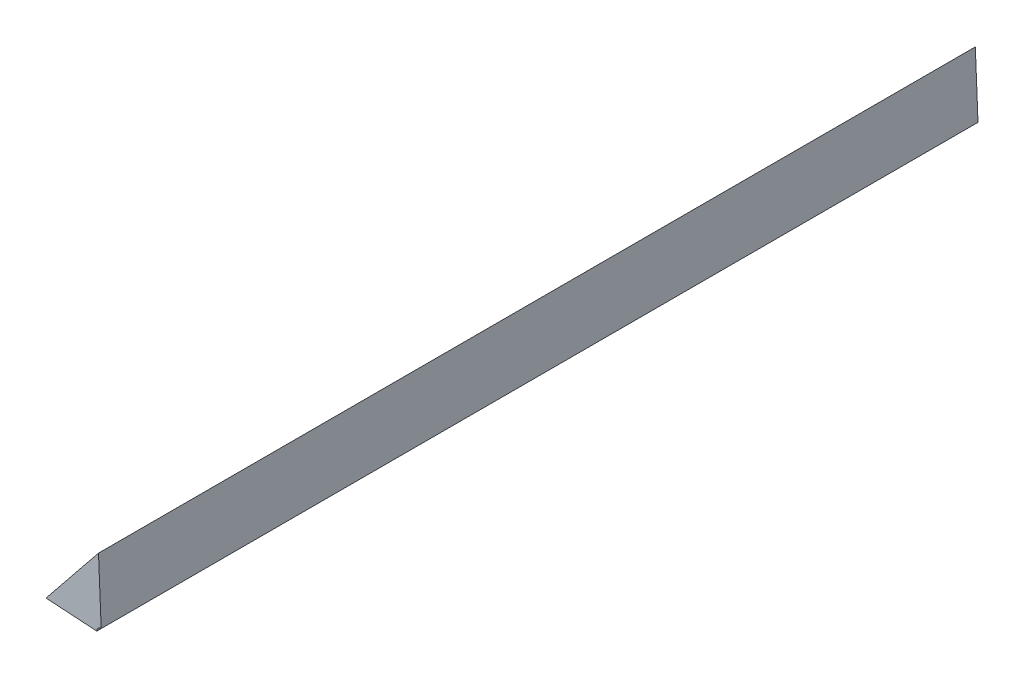
ISO-10303-21;
HEADER;
FILE_DESCRIPTION(('STEP AP214'),'2;1');
FILE_NAME('part.step','',(''),(''),'','','');
FILE_SCHEMA(('AUTOMOTIVE_DESIGN { 1 0 10303 214 1 1 1 1 }'));
ENDSEC;
DATA;
#1=APPLICATION_CONTEXT('core data for automotive mechanical design processes');
#2=APPLICATION_PROTOCOL_DEFINITION('international standard','automotive_design',2000,#1);
#3=PRODUCT_CONTEXT('',#1,'mechanical');
#4=PRODUCT('Part','Part','',(#3));
#5=PRODUCT_RELATED_PRODUCT_CATEGORY('part','',(#4));
#6=PRODUCT_DEFINITION_FORMATION('','',#4);
#7=PRODUCT_DEFINITION_CONTEXT('part definition',#1,'design');
#8=PRODUCT_DEFINITION('design','',#6,#7);
#9=PRODUCT_DEFINITION_SHAPE('','',#8);
#10=(LENGTH_UNIT() NAMED_UNIT(*) SI_UNIT(.MILLI.,.METRE.));
#11=(NAMED_UNIT(*) PLANE_ANGLE_UNIT() SI_UNIT($,.RADIAN.));
#12=(NAMED_UNIT(*) SI_UNIT($,.STERADIAN.) SOLID_ANGLE_UNIT());
#13=UNCERTAINTY_MEASURE_WITH_UNIT(LENGTH_MEASURE(1.E-05),#10,'distance_accuracy_value','');
#14=(GEOMETRIC_REPRESENTATION_CONTEXT(3) GLOBAL_UNCERTAINTY_ASSIGNED_CONTEXT((#13)) GLOBAL_UNIT_ASSIGNED_CONTEXT((#10,
#11,#12)) REPRESENTATION_CONTEXT('',''));
#15=CARTESIAN_POINT('',(0.,0.,0.));
#16=DIRECTION('',(0.,0.,1.));
#17=DIRECTION('',(1.,0.,0.));
#18=AXIS2_PLACEMENT_3D('',#15,#16,#17);
#19=CARTESIAN_POINT('',(-1.301513234463,-0.398546889036204,0.1));
#20=DIRECTION('',(0.,0.,1.));
#21=DIRECTION('',(-1.,0.,0.));
#22=AXIS2_PLACEMENT_3D('',#19,#20,#21);
#23=CYLINDRICAL_SURFACE('',#22,0.0005);
#24=DIRECTION('',(0.,0.,-1.));
#25=VECTOR('',#24,1.);
#26=CARTESIAN_POINT('',(-1.301513234463,-0.398046889036204,0.1));
#27=LINE('',#26,#25);
#28=CARTESIAN_POINT('',(-1.301513234463,-0.398046889036204,0.1));
#29=VERTEX_POINT('',#28);
#30=CARTESIAN_POINT('',(-1.301513234463,-0.398046889036204,0.));
#31=VERTEX_POINT('',#30);
#32=EDGE_CURVE('E11',#29,#31,#27,.T.);
#33=ORIENTED_EDGE('',*,*,#32,.F.);
#34=CARTESIAN_POINT('',(-1.301513234463,-0.398546889036204,0.1));
#35=DIRECTION('',(0.,0.,-1.));
#36=DIRECTION('',(-1.,0.,0.));
#37=AXIS2_PLACEMENT_3D('',#34,#35,#36);
#38=CIRCLE('',#37,0.0005);
#39=CARTESIAN_POINT('',(-1.302013234463,-0.398546889036204,0.1));
#40=VERTEX_POINT('',#39);
#41=EDGE_CURVE('E24',#40,#29,#38,.T.);
#42=ORIENTED_EDGE('',*,*,#41,.F.);
#43=DIRECTION('',(0.,0.,1.));
#44=VECTOR('',#43,1.);
#45=CARTESIAN_POINT('',(-1.302013234463,-0.398546889036204,0.1));
#46=LINE('',#45,#44);
#47=CARTESIAN_POINT('',(-1.302013234463,-0.398546889036204,0.));
#48=VERTEX_POINT('',#47);
#49=EDGE_CURVE('E129',#48,#40,#46,.T.);
#50=ORIENTED_EDGE('',*,*,#49,.F.);
#51=CARTESIAN_POINT('',(-1.301513234463,-0.398546889036204,0.));
#52=DIRECTION('',(0.,0.,1.));
#53=DIRECTION('',(-1.,0.,0.));
#54=AXIS2_PLACEMENT_3D('',#51,#52,#53);
#55=CIRCLE('',#54,0.0005);
#56=EDGE_CURVE('E37',#31,#48,#55,.T.);
#57=ORIENTED_EDGE('',*,*,#56,.F.);
#58=EDGE_LOOP('',(#33,#42,#50,#57));
#59=FACE_BOUND('',#58,.T.);
#60=ADVANCED_FACE('F17',(#59),#23,.F.);
#61=CARTESIAN_POINT('',(-1.301513234463,-0.398546889036204,0.));
#62=DIRECTION('',(0.,1.,0.));
#63=DIRECTION('',(-1.,0.,0.));
#64=AXIS2_PLACEMENT_3D('',#61,#62,#63);
#65=PLANE('',#64);
#66=CARTESIAN_POINT('',(-1.30781490402908,-0.398157899103642,0.));
#67=DIRECTION('',(0.,0.,1.));
#68=VECTOR('',#67,1.);
#69=LINE('',#66,#68);
#70=CARTESIAN_POINT('',(-1.3078058249577,-0.398176901335756,0.));
#71=VERTEX_POINT('',#70);
#72=CARTESIAN_POINT('',(-1.3078058249577,-0.398176901335756,0.1));
#73=VERTEX_POINT('',#72);
#74=EDGE_CURVE('E78',#71,#73,#69,.T.);
#75=ORIENTED_EDGE('',*,*,#74,.F.);
#76=DIRECTION('',(-1.,0.,0.));
#77=VECTOR('',#76,1.);
#78=CARTESIAN_POINT('',(-1.301513234463,-0.398546889036204,0.));
#79=LINE('',#78,#77);
#80=EDGE_CURVE('E111',#48,#71,#79,.T.);
#81=ORIENTED_EDGE('',*,*,#80,.F.);
#82=ORIENTED_EDGE('',*,*,#49,.T.);
#83=DIRECTION('',(-1.,0.,0.));
#84=VECTOR('',#83,1.);
#85=CARTESIAN_POINT('',(-1.301513234463,-0.398546889036204,0.1));
#86=LINE('',#85,#84);
#87=EDGE_CURVE('E130',#40,#73,#86,.T.);
#88=ORIENTED_EDGE('',*,*,#87,.T.);
#89=EDGE_LOOP('',(#75,#81,#82,#88));
#90=FACE_BOUND('',#89,.T.);
#91=ADVANCED_FACE('F101',(#90),#65,.F.);
#92=CARTESIAN_POINT('',(-1.3037516497211,-0.395520360951848,0.));
#93=DIRECTION('',(0.,0.,-1.));
#94=DIRECTION('',(-1.,0.,0.));
#95=AXIS2_PLACEMENT_3D('',#92,#93,#94);
#96=PLANE('',#95);
#97=DIRECTION('',(0.,-1.,0.));
#98=VECTOR('',#97,1.);
#99=CARTESIAN_POINT('',(-1.301513234463,-0.390354849213328,0.));
#100=LINE('',#99,#98);
#101=CARTESIAN_POINT('',(-1.3018184043685,-0.390747010557731,0.));
#102=VERTEX_POINT('',#101);
#103=EDGE_CURVE('E67',#102,#31,#100,.T.);
#104=ORIENTED_EDGE('',*,*,#103,.T.);
#105=ORIENTED_EDGE('',*,*,#56,.T.);
#106=ORIENTED_EDGE('',*,*,#80,.T.);
#107=DIRECTION('',(0.628289208450198,0.777979865128284,0.));
#108=VECTOR('',#107,1.);
#109=CARTESIAN_POINT('',(-1.3081290486333,-0.398546889036204,0.));
#110=LINE('',#109,#108);
#111=EDGE_CURVE('E72',#71,#102,#110,.T.);
#112=ORIENTED_EDGE('',*,*,#111,.T.);
#113=EDGE_LOOP('',(#104,#105,#106,#112));
#114=FACE_BOUND('',#113,.T.);
#115=ADVANCED_FACE('F97',(#114),#96,.T.);
#116=CARTESIAN_POINT('',(-1.301513234463,-0.390354849213328,0.));
#117=DIRECTION('',(-1.,0.,0.));
#118=DIRECTION('',(0.,-1.,0.));
#119=AXIS2_PLACEMENT_3D('',#116,#117,#118);
#120=PLANE('',#119);
#121=ORIENTED_EDGE('',*,*,#32,.T.);
#122=ORIENTED_EDGE('',*,*,#103,.F.);
#123=CARTESIAN_POINT('',(-1.30182737906725,-0.390743839145894,0.1));
#124=DIRECTION('',(0.,0.,-1.));
#125=VECTOR('',#124,1.);
#126=LINE('',#123,#125);
#127=CARTESIAN_POINT('',(-1.3018184043685,-0.390747010557731,0.1));
#128=VERTEX_POINT('',#127);
#129=EDGE_CURVE('E61',#128,#102,#126,.T.);
#130=ORIENTED_EDGE('',*,*,#129,.F.);
#131=DIRECTION('',(0.,-1.,0.));
#132=VECTOR('',#131,1.);
#133=CARTESIAN_POINT('',(-1.301513234463,-0.390354849213328,0.1));
#134=LINE('',#133,#132);
#135=EDGE_CURVE('E55',#128,#29,#134,.T.);
#136=ORIENTED_EDGE('',*,*,#135,.T.);
#137=EDGE_LOOP('',(#121,#122,#130,#136));
#138=FACE_BOUND('',#137,.T.);
#139=ADVANCED_FACE('F65',(#138),#120,.F.);
#140=CARTESIAN_POINT('',(-1.3081290486333,-0.398546889036204,0.));
#141=DIRECTION('',(0.777979865128284,-0.628289208450198,0.));
#142=DIRECTION('',(0.628289208450198,0.777979865128284,0.));
#143=AXIS2_PLACEMENT_3D('',#140,#141,#142);
#144=PLANE('',#143);
#145=ORIENTED_EDGE('',*,*,#74,.T.);
#146=DIRECTION('',(0.628289208450198,0.777979865128284,0.));
#147=VECTOR('',#146,1.);
#148=CARTESIAN_POINT('',(-1.3081290486333,-0.398546889036204,0.1));
#149=LINE('',#148,#147);
#150=EDGE_CURVE('E59',#73,#128,#149,.T.);
#151=ORIENTED_EDGE('',*,*,#150,.T.);
#152=ORIENTED_EDGE('',*,*,#129,.T.);
#153=ORIENTED_EDGE('',*,*,#111,.F.);
#154=EDGE_LOOP('',(#145,#151,#152,#153));
#155=FACE_BOUND('',#154,.T.);
#156=ADVANCED_FACE('F76',(#155),#144,.F.);
#157=CARTESIAN_POINT('',(-1.3037516497211,-0.395520360951848,0.1));
#158=DIRECTION('',(0.,0.,-1.));
#159=DIRECTION('',(-1.,0.,0.));
#160=AXIS2_PLACEMENT_3D('',#157,#158,#159);
#161=PLANE('',#160);
#162=ORIENTED_EDGE('',*,*,#150,.F.);
#163=ORIENTED_EDGE('',*,*,#87,.F.);
#164=ORIENTED_EDGE('',*,*,#41,.T.);
#165=ORIENTED_EDGE('',*,*,#135,.F.);
#166=EDGE_LOOP('',(#162,#163,#164,#165));
#167=FACE_BOUND('',#166,.T.);
#168=ADVANCED_FACE('F57',(#167),#161,.F.);
#169=CLOSED_SHELL('',(#60,#91,#115,#139,#156,#168));
#170=MANIFOLD_SOLID_BREP('B1',#169);
#171=ADVANCED_BREP_SHAPE_REPRESENTATION('',(#18,#170),#14);
#172=SHAPE_DEFINITION_REPRESENTATION(#9,#171);
ENDSEC;
END-ISO-10303-21;
